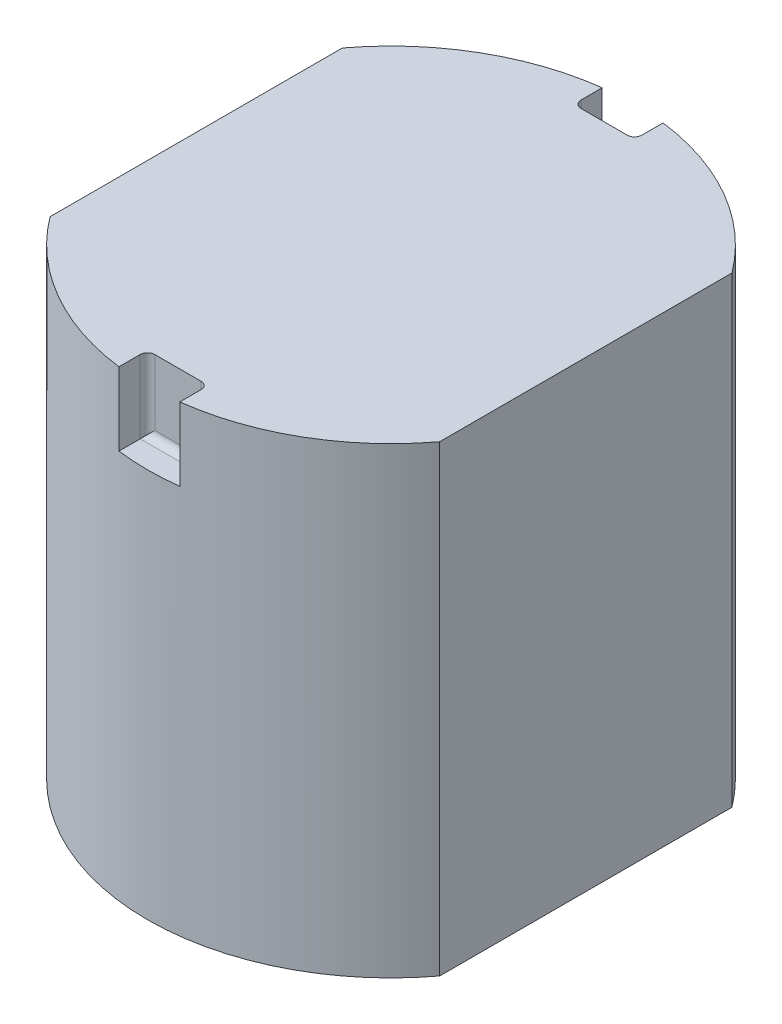
ISO-10303-21;
HEADER;
FILE_DESCRIPTION(('STEP AP214'),'2;1');
FILE_NAME('part.step','',(''),(''),'','','');
FILE_SCHEMA(('AUTOMOTIVE_DESIGN { 1 0 10303 214 1 1 1 1 }'));
ENDSEC;
DATA;
#1=APPLICATION_CONTEXT('core data for automotive mechanical design processes');
#2=APPLICATION_PROTOCOL_DEFINITION('international standard','automotive_design',2000,#1);
#3=PRODUCT_CONTEXT('',#1,'mechanical');
#4=PRODUCT('Part','Part','',(#3));
#5=PRODUCT_RELATED_PRODUCT_CATEGORY('part','',(#4));
#6=PRODUCT_DEFINITION_FORMATION('','',#4);
#7=PRODUCT_DEFINITION_CONTEXT('part definition',#1,'design');
#8=PRODUCT_DEFINITION('design','',#6,#7);
#9=PRODUCT_DEFINITION_SHAPE('','',#8);
#10=(LENGTH_UNIT() NAMED_UNIT(*) SI_UNIT(.MILLI.,.METRE.));
#11=(NAMED_UNIT(*) PLANE_ANGLE_UNIT() SI_UNIT($,.RADIAN.));
#12=(NAMED_UNIT(*) SI_UNIT($,.STERADIAN.) SOLID_ANGLE_UNIT());
#13=UNCERTAINTY_MEASURE_WITH_UNIT(LENGTH_MEASURE(1.E-05),#10,'distance_accuracy_value','');
#14=(GEOMETRIC_REPRESENTATION_CONTEXT(3) GLOBAL_UNCERTAINTY_ASSIGNED_CONTEXT((#13)) GLOBAL_UNIT_ASSIGNED_CONTEXT((#10,
#11,#12)) REPRESENTATION_CONTEXT('',''));
#15=CARTESIAN_POINT('',(0.,0.,0.));
#16=DIRECTION('',(0.,0.,1.));
#17=DIRECTION('',(1.,0.,0.));
#18=AXIS2_PLACEMENT_3D('',#15,#16,#17);
#19=CARTESIAN_POINT('',(0.,19.,0.));
#20=DIRECTION('',(0.,-1.,0.));
#21=DIRECTION('',(0.,0.,-1.));
#22=AXIS2_PLACEMENT_3D('',#19,#20,#21);
#23=CYLINDRICAL_SURFACE('',#22,10.);
#24=DIRECTION('',(0.,-1.,0.));
#25=VECTOR('',#24,1.);
#26=CARTESIAN_POINT('',(1.25,19.,-9.92156741649222));
#27=LINE('',#26,#25);
#28=CARTESIAN_POINT('',(1.25,19.,-9.92156741649222));
#29=VERTEX_POINT('',#28);
#30=CARTESIAN_POINT('',(1.25,16.,-9.92156741649222));
#31=VERTEX_POINT('',#30);
#32=EDGE_CURVE('E180',#29,#31,#27,.T.);
#33=ORIENTED_EDGE('',*,*,#32,.F.);
#34=CARTESIAN_POINT('',(0.,19.,0.));
#35=DIRECTION('',(0.,1.,0.));
#36=DIRECTION('',(0.,0.,1.));
#37=AXIS2_PLACEMENT_3D('',#34,#35,#36);
#38=CIRCLE('',#37,10.);
#39=CARTESIAN_POINT('',(8.,19.,-6.));
#40=VERTEX_POINT('',#39);
#41=EDGE_CURVE('E204',#40,#29,#38,.T.);
#42=ORIENTED_EDGE('',*,*,#41,.F.);
#43=DIRECTION('',(0.,-1.,0.));
#44=VECTOR('',#43,1.);
#45=CARTESIAN_POINT('',(8.,19.,-6.));
#46=LINE('',#45,#44);
#47=CARTESIAN_POINT('',(8.,0.,-6.));
#48=VERTEX_POINT('',#47);
#49=EDGE_CURVE('E215',#40,#48,#46,.T.);
#50=ORIENTED_EDGE('',*,*,#49,.T.);
#51=CARTESIAN_POINT('',(0.,0.,0.));
#52=DIRECTION('',(0.,1.,0.));
#53=DIRECTION('',(0.,0.,1.));
#54=AXIS2_PLACEMENT_3D('',#51,#52,#53);
#55=CIRCLE('',#54,10.);
#56=CARTESIAN_POINT('',(-8.,0.,-6.));
#57=VERTEX_POINT('',#56);
#58=EDGE_CURVE('E203',#48,#57,#55,.T.);
#59=ORIENTED_EDGE('',*,*,#58,.T.);
#60=DIRECTION('',(0.,-1.,0.));
#61=VECTOR('',#60,1.);
#62=CARTESIAN_POINT('',(-8.,19.,-6.));
#63=LINE('',#62,#61);
#64=CARTESIAN_POINT('',(-8.,19.,-6.));
#65=VERTEX_POINT('',#64);
#66=EDGE_CURVE('E232',#65,#57,#63,.T.);
#67=ORIENTED_EDGE('',*,*,#66,.F.);
#68=CARTESIAN_POINT('',(-1.25,19.,-9.92156741649222));
#69=VERTEX_POINT('',#68);
#70=EDGE_CURVE('E179',#69,#65,#38,.T.);
#71=ORIENTED_EDGE('',*,*,#70,.F.);
#72=DIRECTION('',(0.,-1.,0.));
#73=VECTOR('',#72,1.);
#74=CARTESIAN_POINT('',(-1.25,19.,-9.92156741649222));
#75=LINE('',#74,#73);
#76=CARTESIAN_POINT('',(-1.25,16.,-9.92156741649222));
#77=VERTEX_POINT('',#76);
#78=EDGE_CURVE('E160',#77,#69,#75,.F.);
#79=ORIENTED_EDGE('',*,*,#78,.F.);
#80=CARTESIAN_POINT('',(0.,16.,0.));
#81=DIRECTION('',(0.,1.,0.));
#82=DIRECTION('',(0.,0.,1.));
#83=AXIS2_PLACEMENT_3D('',#80,#81,#82);
#84=CIRCLE('',#83,10.);
#85=EDGE_CURVE('E170',#31,#77,#84,.T.);
#86=ORIENTED_EDGE('',*,*,#85,.F.);
#87=EDGE_LOOP('',(#33,#42,#50,#59,#67,#71,#79,#86));
#88=FACE_BOUND('',#87,.T.);
#89=ADVANCED_FACE('F39',(#88),#23,.T.);
#90=CARTESIAN_POINT('',(0.,19.,0.));
#91=DIRECTION('',(0.,1.,0.));
#92=DIRECTION('',(0.,0.,1.));
#93=AXIS2_PLACEMENT_3D('',#90,#91,#92);
#94=PLANE('',#93);
#95=ORIENTED_EDGE('',*,*,#41,.T.);
#96=DIRECTION('',(0.,0.,1.));
#97=VECTOR('',#96,1.);
#98=CARTESIAN_POINT('',(1.25,19.,0.));
#99=LINE('',#98,#97);
#100=CARTESIAN_POINT('',(1.25,19.,-9.05));
#101=VERTEX_POINT('',#100);
#102=EDGE_CURVE('E176',#29,#101,#99,.T.);
#103=ORIENTED_EDGE('',*,*,#102,.T.);
#104=CARTESIAN_POINT('',(0.950000000000001,19.,-9.05));
#105=DIRECTION('',(0.,1.,0.));
#106=DIRECTION('',(0.,0.,1.));
#107=AXIS2_PLACEMENT_3D('',#104,#105,#106);
#108=CIRCLE('',#107,0.3);
#109=CARTESIAN_POINT('',(0.950000000000001,19.,-8.75));
#110=VERTEX_POINT('',#109);
#111=EDGE_CURVE('E264',#101,#110,#108,.F.);
#112=ORIENTED_EDGE('',*,*,#111,.T.);
#113=DIRECTION('',(-1.,0.,0.));
#114=VECTOR('',#113,1.);
#115=CARTESIAN_POINT('',(-1.25,19.,-8.75));
#116=LINE('',#115,#114);
#117=CARTESIAN_POINT('',(-0.95,19.,-8.75));
#118=VERTEX_POINT('',#117);
#119=EDGE_CURVE('E185',#110,#118,#116,.T.);
#120=ORIENTED_EDGE('',*,*,#119,.T.);
#121=CARTESIAN_POINT('',(-0.95,19.,-9.05));
#122=DIRECTION('',(0.,1.,0.));
#123=DIRECTION('',(0.,0.,1.));
#124=AXIS2_PLACEMENT_3D('',#121,#122,#123);
#125=CIRCLE('',#124,0.3);
#126=CARTESIAN_POINT('',(-1.25,19.,-9.05));
#127=VERTEX_POINT('',#126);
#128=EDGE_CURVE('E266',#118,#127,#125,.F.);
#129=ORIENTED_EDGE('',*,*,#128,.T.);
#130=DIRECTION('',(0.,0.,-1.));
#131=VECTOR('',#130,1.);
#132=CARTESIAN_POINT('',(-1.25,19.,-8.75));
#133=LINE('',#132,#131);
#134=EDGE_CURVE('E273',#127,#69,#133,.T.);
#135=ORIENTED_EDGE('',*,*,#134,.T.);
#136=ORIENTED_EDGE('',*,*,#70,.T.);
#137=DIRECTION('',(0.,0.,1.));
#138=VECTOR('',#137,1.);
#139=CARTESIAN_POINT('',(-8.,19.,6.));
#140=LINE('',#139,#138);
#141=CARTESIAN_POINT('',(-8.,19.,6.));
#142=VERTEX_POINT('',#141);
#143=EDGE_CURVE('E207',#65,#142,#140,.T.);
#144=ORIENTED_EDGE('',*,*,#143,.T.);
#145=CARTESIAN_POINT('',(0.,19.,0.));
#146=DIRECTION('',(0.,1.,0.));
#147=DIRECTION('',(0.,0.,1.));
#148=AXIS2_PLACEMENT_3D('',#145,#146,#147);
#149=CIRCLE('',#148,10.);
#150=CARTESIAN_POINT('',(-1.25,19.,9.92156741649222));
#151=VERTEX_POINT('',#150);
#152=EDGE_CURVE('E210',#142,#151,#149,.T.);
#153=ORIENTED_EDGE('',*,*,#152,.T.);
#154=DIRECTION('',(0.,0.,1.));
#155=VECTOR('',#154,1.);
#156=CARTESIAN_POINT('',(-1.25,19.,8.75));
#157=LINE('',#156,#155);
#158=CARTESIAN_POINT('',(-1.25,19.,9.05));
#159=VERTEX_POINT('',#158);
#160=EDGE_CURVE('E192',#159,#151,#157,.T.);
#161=ORIENTED_EDGE('',*,*,#160,.F.);
#162=CARTESIAN_POINT('',(-0.95,19.,9.05));
#163=DIRECTION('',(0.,1.,0.));
#164=DIRECTION('',(0.,0.,1.));
#165=AXIS2_PLACEMENT_3D('',#162,#163,#164);
#166=CIRCLE('',#165,0.3);
#167=CARTESIAN_POINT('',(-0.95,19.,8.75));
#168=VERTEX_POINT('',#167);
#169=EDGE_CURVE('E11',#159,#168,#166,.F.);
#170=ORIENTED_EDGE('',*,*,#169,.T.);
#171=DIRECTION('',(-1.,0.,0.));
#172=VECTOR('',#171,1.);
#173=CARTESIAN_POINT('',(-1.25,19.,8.75));
#174=LINE('',#173,#172);
#175=CARTESIAN_POINT('',(0.950000000000001,19.,8.75));
#176=VERTEX_POINT('',#175);
#177=EDGE_CURVE('E182',#176,#168,#174,.T.);
#178=ORIENTED_EDGE('',*,*,#177,.F.);
#179=CARTESIAN_POINT('',(0.950000000000001,19.,9.05));
#180=DIRECTION('',(0.,1.,0.));
#181=DIRECTION('',(0.,0.,1.));
#182=AXIS2_PLACEMENT_3D('',#179,#180,#181);
#183=CIRCLE('',#182,0.3);
#184=CARTESIAN_POINT('',(1.25,19.,9.05));
#185=VERTEX_POINT('',#184);
#186=EDGE_CURVE('E48',#176,#185,#183,.F.);
#187=ORIENTED_EDGE('',*,*,#186,.T.);
#188=DIRECTION('',(0.,0.,-1.));
#189=VECTOR('',#188,1.);
#190=CARTESIAN_POINT('',(1.25,19.,0.));
#191=LINE('',#190,#189);
#192=CARTESIAN_POINT('',(1.25,19.,9.92156741649222));
#193=VERTEX_POINT('',#192);
#194=EDGE_CURVE('E235',#193,#185,#191,.T.);
#195=ORIENTED_EDGE('',*,*,#194,.F.);
#196=CARTESIAN_POINT('',(8.,19.,6.));
#197=VERTEX_POINT('',#196);
#198=EDGE_CURVE('E209',#193,#197,#149,.T.);
#199=ORIENTED_EDGE('',*,*,#198,.T.);
#200=DIRECTION('',(0.,0.,-1.));
#201=VECTOR('',#200,1.);
#202=CARTESIAN_POINT('',(8.,19.,6.));
#203=LINE('',#202,#201);
#204=EDGE_CURVE('E213',#197,#40,#203,.T.);
#205=ORIENTED_EDGE('',*,*,#204,.T.);
#206=EDGE_LOOP('',(#95,#103,#112,#120,#129,#135,#136,#144,#153,#161,#170,#178,#187,#195,#199,#205));
#207=FACE_BOUND('',#206,.T.);
#208=ADVANCED_FACE('F288',(#207),#94,.T.);
#209=CARTESIAN_POINT('',(-8.,19.,6.));
#210=DIRECTION('',(1.,0.,0.));
#211=DIRECTION('',(0.,0.,-1.));
#212=AXIS2_PLACEMENT_3D('',#209,#210,#211);
#213=PLANE('',#212);
#214=DIRECTION('',(0.,0.,1.));
#215=VECTOR('',#214,1.);
#216=CARTESIAN_POINT('',(-8.,0.,6.));
#217=LINE('',#216,#215);
#218=CARTESIAN_POINT('',(-8.,0.,6.));
#219=VERTEX_POINT('',#218);
#220=EDGE_CURVE('E218',#57,#219,#217,.T.);
#221=ORIENTED_EDGE('',*,*,#220,.T.);
#222=DIRECTION('',(0.,-1.,0.));
#223=VECTOR('',#222,1.);
#224=CARTESIAN_POINT('',(-8.,19.,6.));
#225=LINE('',#224,#223);
#226=EDGE_CURVE('E229',#142,#219,#225,.T.);
#227=ORIENTED_EDGE('',*,*,#226,.F.);
#228=ORIENTED_EDGE('',*,*,#143,.F.);
#229=ORIENTED_EDGE('',*,*,#66,.T.);
#230=EDGE_LOOP('',(#221,#227,#228,#229));
#231=FACE_BOUND('',#230,.T.);
#232=ADVANCED_FACE('F349',(#231),#213,.F.);
#233=CARTESIAN_POINT('',(0.,19.,0.));
#234=DIRECTION('',(0.,-1.,0.));
#235=DIRECTION('',(0.,0.,-1.));
#236=AXIS2_PLACEMENT_3D('',#233,#234,#235);
#237=CYLINDRICAL_SURFACE('',#236,10.);
#238=ORIENTED_EDGE('',*,*,#198,.F.);
#239=DIRECTION('',(0.,-1.,0.));
#240=VECTOR('',#239,1.);
#241=CARTESIAN_POINT('',(1.25,19.,9.92156741649222));
#242=LINE('',#241,#240);
#243=CARTESIAN_POINT('',(1.25,16.,9.92156741649222));
#244=VERTEX_POINT('',#243);
#245=EDGE_CURVE('E200',#193,#244,#242,.T.);
#246=ORIENTED_EDGE('',*,*,#245,.T.);
#247=CARTESIAN_POINT('',(0.,16.,0.));
#248=DIRECTION('',(0.,1.,0.));
#249=DIRECTION('',(0.,0.,1.));
#250=AXIS2_PLACEMENT_3D('',#247,#248,#249);
#251=CIRCLE('',#250,10.);
#252=CARTESIAN_POINT('',(-1.25,16.,9.92156741649222));
#253=VERTEX_POINT('',#252);
#254=EDGE_CURVE('E237',#253,#244,#251,.T.);
#255=ORIENTED_EDGE('',*,*,#254,.F.);
#256=DIRECTION('',(0.,-1.,0.));
#257=VECTOR('',#256,1.);
#258=CARTESIAN_POINT('',(-1.25,19.,9.92156741649222));
#259=LINE('',#258,#257);
#260=EDGE_CURVE('E194',#253,#151,#259,.F.);
#261=ORIENTED_EDGE('',*,*,#260,.T.);
#262=ORIENTED_EDGE('',*,*,#152,.F.);
#263=ORIENTED_EDGE('',*,*,#226,.T.);
#264=CARTESIAN_POINT('',(0.,0.,0.));
#265=DIRECTION('',(0.,1.,0.));
#266=DIRECTION('',(0.,0.,1.));
#267=AXIS2_PLACEMENT_3D('',#264,#265,#266);
#268=CIRCLE('',#267,10.);
#269=CARTESIAN_POINT('',(8.,0.,6.));
#270=VERTEX_POINT('',#269);
#271=EDGE_CURVE('E220',#219,#270,#268,.T.);
#272=ORIENTED_EDGE('',*,*,#271,.T.);
#273=DIRECTION('',(0.,-1.,0.));
#274=VECTOR('',#273,1.);
#275=CARTESIAN_POINT('',(8.,19.,6.));
#276=LINE('',#275,#274);
#277=EDGE_CURVE('E226',#197,#270,#276,.T.);
#278=ORIENTED_EDGE('',*,*,#277,.F.);
#279=EDGE_LOOP('',(#238,#246,#255,#261,#262,#263,#272,#278));
#280=FACE_BOUND('',#279,.T.);
#281=ADVANCED_FACE('F301',(#280),#237,.T.);
#282=CARTESIAN_POINT('',(8.,19.,6.));
#283=DIRECTION('',(-1.,0.,0.));
#284=DIRECTION('',(0.,0.,1.));
#285=AXIS2_PLACEMENT_3D('',#282,#283,#284);
#286=PLANE('',#285);
#287=DIRECTION('',(0.,0.,-1.));
#288=VECTOR('',#287,1.);
#289=CARTESIAN_POINT('',(8.,0.,6.));
#290=LINE('',#289,#288);
#291=EDGE_CURVE('E222',#270,#48,#290,.T.);
#292=ORIENTED_EDGE('',*,*,#291,.T.);
#293=ORIENTED_EDGE('',*,*,#49,.F.);
#294=ORIENTED_EDGE('',*,*,#204,.F.);
#295=ORIENTED_EDGE('',*,*,#277,.T.);
#296=EDGE_LOOP('',(#292,#293,#294,#295));
#297=FACE_BOUND('',#296,.T.);
#298=ADVANCED_FACE('F310',(#297),#286,.F.);
#299=CARTESIAN_POINT('',(0.,0.,0.));
#300=DIRECTION('',(0.,1.,0.));
#301=DIRECTION('',(0.,0.,1.));
#302=AXIS2_PLACEMENT_3D('',#299,#300,#301);
#303=PLANE('',#302);
#304=ORIENTED_EDGE('',*,*,#58,.F.);
#305=ORIENTED_EDGE('',*,*,#291,.F.);
#306=ORIENTED_EDGE('',*,*,#271,.F.);
#307=ORIENTED_EDGE('',*,*,#220,.F.);
#308=EDGE_LOOP('',(#304,#305,#306,#307));
#309=FACE_BOUND('',#308,.T.);
#310=ADVANCED_FACE('F358',(#309),#303,.F.);
#311=CARTESIAN_POINT('',(0.,16.,0.));
#312=DIRECTION('',(0.,1.,0.));
#313=DIRECTION('',(0.,0.,1.));
#314=AXIS2_PLACEMENT_3D('',#311,#312,#313);
#315=PLANE('',#314);
#316=DIRECTION('',(0.,0.,-1.));
#317=VECTOR('',#316,1.);
#318=CARTESIAN_POINT('',(1.25,16.,8.75));
#319=LINE('',#318,#317);
#320=CARTESIAN_POINT('',(1.25,16.,9.05));
#321=VERTEX_POINT('',#320);
#322=EDGE_CURVE('E188',#244,#321,#319,.T.);
#323=ORIENTED_EDGE('',*,*,#322,.T.);
#324=DIRECTION('',(-1.,0.,0.));
#325=VECTOR('',#324,1.);
#326=CARTESIAN_POINT('',(0.,16.,9.05));
#327=LINE('',#326,#325);
#328=CARTESIAN_POINT('',(-1.25,16.,9.05));
#329=VERTEX_POINT('',#328);
#330=EDGE_CURVE('E249',#321,#329,#327,.T.);
#331=ORIENTED_EDGE('',*,*,#330,.T.);
#332=DIRECTION('',(0.,0.,1.));
#333=VECTOR('',#332,1.);
#334=CARTESIAN_POINT('',(-1.25,16.,8.75));
#335=LINE('',#334,#333);
#336=EDGE_CURVE('E191',#329,#253,#335,.T.);
#337=ORIENTED_EDGE('',*,*,#336,.T.);
#338=ORIENTED_EDGE('',*,*,#254,.T.);
#339=EDGE_LOOP('',(#323,#331,#337,#338));
#340=FACE_BOUND('',#339,.T.);
#341=ADVANCED_FACE('F293',(#340),#315,.T.);
#342=CARTESIAN_POINT('',(1.25,16.,8.75));
#343=DIRECTION('',(1.,0.,0.));
#344=DIRECTION('',(0.,0.,-1.));
#345=AXIS2_PLACEMENT_3D('',#342,#343,#344);
#346=PLANE('',#345);
#347=ORIENTED_EDGE('',*,*,#194,.T.);
#348=DIRECTION('',(0.,1.,0.));
#349=VECTOR('',#348,1.);
#350=CARTESIAN_POINT('',(1.25,16.,9.05));
#351=LINE('',#350,#349);
#352=EDGE_CURVE('E261',#185,#321,#351,.F.);
#353=ORIENTED_EDGE('',*,*,#352,.T.);
#354=ORIENTED_EDGE('',*,*,#322,.F.);
#355=ORIENTED_EDGE('',*,*,#245,.F.);
#356=EDGE_LOOP('',(#347,#353,#354,#355));
#357=FACE_BOUND('',#356,.T.);
#358=ADVANCED_FACE('F303',(#357),#346,.F.);
#359=CARTESIAN_POINT('',(-1.25,16.,8.75));
#360=DIRECTION('',(-1.,0.,0.));
#361=DIRECTION('',(0.,0.,1.));
#362=AXIS2_PLACEMENT_3D('',#359,#360,#361);
#363=PLANE('',#362);
#364=ORIENTED_EDGE('',*,*,#336,.F.);
#365=DIRECTION('',(0.,1.,0.));
#366=VECTOR('',#365,1.);
#367=CARTESIAN_POINT('',(-1.25,19.,9.05));
#368=LINE('',#367,#366);
#369=EDGE_CURVE('E56',#329,#159,#368,.T.);
#370=ORIENTED_EDGE('',*,*,#369,.T.);
#371=ORIENTED_EDGE('',*,*,#160,.T.);
#372=ORIENTED_EDGE('',*,*,#260,.F.);
#373=EDGE_LOOP('',(#364,#370,#371,#372));
#374=FACE_BOUND('',#373,.T.);
#375=ADVANCED_FACE('F296',(#374),#363,.F.);
#376=CARTESIAN_POINT('',(-1.25,16.,8.75));
#377=DIRECTION('',(0.,0.,-1.));
#378=DIRECTION('',(-1.,0.,0.));
#379=AXIS2_PLACEMENT_3D('',#376,#377,#378);
#380=PLANE('',#379);
#381=DIRECTION('',(-1.,0.,0.));
#382=VECTOR('',#381,1.);
#383=CARTESIAN_POINT('',(-1.25,16.3,8.75));
#384=LINE('',#383,#382);
#385=CARTESIAN_POINT('',(-0.95,16.3,8.75));
#386=VERTEX_POINT('',#385);
#387=CARTESIAN_POINT('',(0.950000000000001,16.3,8.75));
#388=VERTEX_POINT('',#387);
#389=EDGE_CURVE('E254',#386,#388,#384,.F.);
#390=ORIENTED_EDGE('',*,*,#389,.T.);
#391=DIRECTION('',(0.,1.,0.));
#392=VECTOR('',#391,1.);
#393=CARTESIAN_POINT('',(0.950000000000001,19.,8.75));
#394=LINE('',#393,#392);
#395=EDGE_CURVE('E256',#388,#176,#394,.T.);
#396=ORIENTED_EDGE('',*,*,#395,.T.);
#397=ORIENTED_EDGE('',*,*,#177,.T.);
#398=DIRECTION('',(0.,1.,0.));
#399=VECTOR('',#398,1.);
#400=CARTESIAN_POINT('',(-0.95,16.,8.75));
#401=LINE('',#400,#399);
#402=EDGE_CURVE('E252',#168,#386,#401,.F.);
#403=ORIENTED_EDGE('',*,*,#402,.T.);
#404=EDGE_LOOP('',(#390,#396,#397,#403));
#405=FACE_BOUND('',#404,.T.);
#406=ADVANCED_FACE('F286',(#405),#380,.F.);
#407=CARTESIAN_POINT('',(0.,16.,0.));
#408=DIRECTION('',(0.,1.,0.));
#409=DIRECTION('',(0.,0.,-1.));
#410=AXIS2_PLACEMENT_3D('',#407,#408,#409);
#411=PLANE('',#410);
#412=DIRECTION('',(0.,0.,-1.));
#413=VECTOR('',#412,1.);
#414=CARTESIAN_POINT('',(-1.25,16.,-8.75));
#415=LINE('',#414,#413);
#416=CARTESIAN_POINT('',(-1.25,16.,-9.05));
#417=VERTEX_POINT('',#416);
#418=EDGE_CURVE('E155',#417,#77,#415,.T.);
#419=ORIENTED_EDGE('',*,*,#418,.F.);
#420=DIRECTION('',(-1.,0.,0.));
#421=VECTOR('',#420,1.);
#422=CARTESIAN_POINT('',(1.25,16.,-9.05));
#423=LINE('',#422,#421);
#424=CARTESIAN_POINT('',(1.25,16.,-9.05));
#425=VERTEX_POINT('',#424);
#426=EDGE_CURVE('E247',#417,#425,#423,.F.);
#427=ORIENTED_EDGE('',*,*,#426,.T.);
#428=DIRECTION('',(0.,0.,1.));
#429=VECTOR('',#428,1.);
#430=CARTESIAN_POINT('',(1.25,16.,-8.75));
#431=LINE('',#430,#429);
#432=EDGE_CURVE('E166',#31,#425,#431,.T.);
#433=ORIENTED_EDGE('',*,*,#432,.F.);
#434=ORIENTED_EDGE('',*,*,#85,.T.);
#435=EDGE_LOOP('',(#419,#427,#433,#434));
#436=FACE_BOUND('',#435,.T.);
#437=ADVANCED_FACE('F171',(#436),#411,.T.);
#438=CARTESIAN_POINT('',(1.25,16.,-8.75));
#439=DIRECTION('',(-1.,0.,0.));
#440=DIRECTION('',(0.,0.,1.));
#441=AXIS2_PLACEMENT_3D('',#438,#439,#440);
#442=PLANE('',#441);
#443=ORIENTED_EDGE('',*,*,#432,.T.);
#444=DIRECTION('',(0.,1.,0.));
#445=VECTOR('',#444,1.);
#446=CARTESIAN_POINT('',(1.25,19.,-9.05));
#447=LINE('',#446,#445);
#448=EDGE_CURVE('E258',#425,#101,#447,.T.);
#449=ORIENTED_EDGE('',*,*,#448,.T.);
#450=ORIENTED_EDGE('',*,*,#102,.F.);
#451=ORIENTED_EDGE('',*,*,#32,.T.);
#452=EDGE_LOOP('',(#443,#449,#450,#451));
#453=FACE_BOUND('',#452,.T.);
#454=ADVANCED_FACE('F315',(#453),#442,.T.);
#455=CARTESIAN_POINT('',(-1.25,16.,-8.75));
#456=DIRECTION('',(1.,0.,0.));
#457=DIRECTION('',(0.,0.,-1.));
#458=AXIS2_PLACEMENT_3D('',#455,#456,#457);
#459=PLANE('',#458);
#460=ORIENTED_EDGE('',*,*,#134,.F.);
#461=DIRECTION('',(0.,1.,0.));
#462=VECTOR('',#461,1.);
#463=CARTESIAN_POINT('',(-1.25,16.,-9.05));
#464=LINE('',#463,#462);
#465=EDGE_CURVE('E163',#127,#417,#464,.F.);
#466=ORIENTED_EDGE('',*,*,#465,.T.);
#467=ORIENTED_EDGE('',*,*,#418,.T.);
#468=ORIENTED_EDGE('',*,*,#78,.T.);
#469=EDGE_LOOP('',(#460,#466,#467,#468));
#470=FACE_BOUND('',#469,.T.);
#471=ADVANCED_FACE('F158',(#470),#459,.T.);
#472=CARTESIAN_POINT('',(-1.25,16.,-8.75));
#473=DIRECTION('',(0.,0.,-1.));
#474=DIRECTION('',(-1.,0.,0.));
#475=AXIS2_PLACEMENT_3D('',#472,#473,#474);
#476=PLANE('',#475);
#477=ORIENTED_EDGE('',*,*,#119,.F.);
#478=DIRECTION('',(0.,1.,0.));
#479=VECTOR('',#478,1.);
#480=CARTESIAN_POINT('',(0.950000000000001,16.,-8.75));
#481=LINE('',#480,#479);
#482=CARTESIAN_POINT('',(0.950000000000001,16.3,-8.75));
#483=VERTEX_POINT('',#482);
#484=EDGE_CURVE('E245',#110,#483,#481,.F.);
#485=ORIENTED_EDGE('',*,*,#484,.T.);
#486=DIRECTION('',(-1.,0.,0.));
#487=VECTOR('',#486,1.);
#488=CARTESIAN_POINT('',(-1.25,16.3,-8.75));
#489=LINE('',#488,#487);
#490=CARTESIAN_POINT('',(-0.95,16.3,-8.75));
#491=VERTEX_POINT('',#490);
#492=EDGE_CURVE('E242',#483,#491,#489,.T.);
#493=ORIENTED_EDGE('',*,*,#492,.T.);
#494=DIRECTION('',(0.,1.,0.));
#495=VECTOR('',#494,1.);
#496=CARTESIAN_POINT('',(-0.95,19.,-8.75));
#497=LINE('',#496,#495);
#498=EDGE_CURVE('E175',#491,#118,#497,.T.);
#499=ORIENTED_EDGE('',*,*,#498,.T.);
#500=EDGE_LOOP('',(#477,#485,#493,#499));
#501=FACE_BOUND('',#500,.T.);
#502=ADVANCED_FACE('F328',(#501),#476,.T.);
#503=CARTESIAN_POINT('',(0.950000000000001,16.,-9.05));
#504=DIRECTION('',(0.,-1.,0.));
#505=DIRECTION('',(0.,0.,-1.));
#506=AXIS2_PLACEMENT_3D('',#503,#504,#505);
#507=CYLINDRICAL_SURFACE('',#506,0.3);
#508=ORIENTED_EDGE('',*,*,#111,.F.);
#509=ORIENTED_EDGE('',*,*,#448,.F.);
#510=CARTESIAN_POINT('',(0.950000000000001,16.3,-9.05));
#511=DIRECTION('',(0.707106781186547,0.707106781186547,0.));
#512=DIRECTION('',(0.707106781186547,-0.707106781186547,0.));
#513=AXIS2_PLACEMENT_3D('',#510,#511,#512);
#514=ELLIPSE('',#513,0.424264068711928,0.3);
#515=EDGE_CURVE('E271',#483,#425,#514,.T.);
#516=ORIENTED_EDGE('',*,*,#515,.F.);
#517=ORIENTED_EDGE('',*,*,#484,.F.);
#518=EDGE_LOOP('',(#508,#509,#516,#517));
#519=FACE_BOUND('',#518,.T.);
#520=ADVANCED_FACE('F319',(#519),#507,.F.);
#521=CARTESIAN_POINT('',(-0.95,16.,-9.05));
#522=DIRECTION('',(0.,-1.,0.));
#523=DIRECTION('',(0.,0.,-1.));
#524=AXIS2_PLACEMENT_3D('',#521,#522,#523);
#525=CYLINDRICAL_SURFACE('',#524,0.3);
#526=ORIENTED_EDGE('',*,*,#128,.F.);
#527=ORIENTED_EDGE('',*,*,#498,.F.);
#528=CARTESIAN_POINT('',(-0.95,16.3,-9.05));
#529=DIRECTION('',(0.707106781186547,-0.707106781186547,0.));
#530=DIRECTION('',(0.707106781186547,0.707106781186547,0.));
#531=AXIS2_PLACEMENT_3D('',#528,#529,#530);
#532=ELLIPSE('',#531,0.424264068711928,0.3);
#533=EDGE_CURVE('E269',#417,#491,#532,.F.);
#534=ORIENTED_EDGE('',*,*,#533,.F.);
#535=ORIENTED_EDGE('',*,*,#465,.F.);
#536=EDGE_LOOP('',(#526,#527,#534,#535));
#537=FACE_BOUND('',#536,.T.);
#538=ADVANCED_FACE('F334',(#537),#525,.F.);
#539=CARTESIAN_POINT('',(-1.25,16.3,-9.05));
#540=DIRECTION('',(1.,0.,0.));
#541=DIRECTION('',(0.,0.,-1.));
#542=AXIS2_PLACEMENT_3D('',#539,#540,#541);
#543=CYLINDRICAL_SURFACE('',#542,0.3);
#544=ORIENTED_EDGE('',*,*,#515,.T.);
#545=ORIENTED_EDGE('',*,*,#426,.F.);
#546=ORIENTED_EDGE('',*,*,#533,.T.);
#547=ORIENTED_EDGE('',*,*,#492,.F.);
#548=EDGE_LOOP('',(#544,#545,#546,#547));
#549=FACE_BOUND('',#548,.T.);
#550=ADVANCED_FACE('F323',(#549),#543,.F.);
#551=CARTESIAN_POINT('',(0.950000000000001,16.,9.05));
#552=DIRECTION('',(0.,-1.,0.));
#553=DIRECTION('',(0.,0.,-1.));
#554=AXIS2_PLACEMENT_3D('',#551,#552,#553);
#555=CYLINDRICAL_SURFACE('',#554,0.3);
#556=ORIENTED_EDGE('',*,*,#186,.F.);
#557=ORIENTED_EDGE('',*,*,#395,.F.);
#558=CARTESIAN_POINT('',(0.950000000000001,16.3,9.05));
#559=DIRECTION('',(-0.707106781186547,-0.707106781186547,0.));
#560=DIRECTION('',(-0.707106781186547,0.707106781186547,0.));
#561=AXIS2_PLACEMENT_3D('',#558,#559,#560);
#562=ELLIPSE('',#561,0.424264068711928,0.3);
#563=EDGE_CURVE('E43',#321,#388,#562,.F.);
#564=ORIENTED_EDGE('',*,*,#563,.F.);
#565=ORIENTED_EDGE('',*,*,#352,.F.);
#566=EDGE_LOOP('',(#556,#557,#564,#565));
#567=FACE_BOUND('',#566,.T.);
#568=ADVANCED_FACE('F41',(#567),#555,.F.);
#569=CARTESIAN_POINT('',(-0.95,16.,9.05));
#570=DIRECTION('',(0.,-1.,0.));
#571=DIRECTION('',(0.,0.,-1.));
#572=AXIS2_PLACEMENT_3D('',#569,#570,#571);
#573=CYLINDRICAL_SURFACE('',#572,0.3);
#574=ORIENTED_EDGE('',*,*,#169,.F.);
#575=ORIENTED_EDGE('',*,*,#369,.F.);
#576=CARTESIAN_POINT('',(-0.95,16.3,9.05));
#577=DIRECTION('',(-0.707106781186547,0.707106781186547,0.));
#578=DIRECTION('',(-0.707106781186547,-0.707106781186547,0.));
#579=AXIS2_PLACEMENT_3D('',#576,#577,#578);
#580=ELLIPSE('',#579,0.424264068711928,0.3);
#581=EDGE_CURVE('E274',#386,#329,#580,.T.);
#582=ORIENTED_EDGE('',*,*,#581,.F.);
#583=ORIENTED_EDGE('',*,*,#402,.F.);
#584=EDGE_LOOP('',(#574,#575,#582,#583));
#585=FACE_BOUND('',#584,.T.);
#586=ADVANCED_FACE('F291',(#585),#573,.F.);
#587=CARTESIAN_POINT('',(0.,16.3,9.05));
#588=DIRECTION('',(-1.,0.,0.));
#589=DIRECTION('',(0.,0.,1.));
#590=AXIS2_PLACEMENT_3D('',#587,#588,#589);
#591=CYLINDRICAL_SURFACE('',#590,0.3);
#592=ORIENTED_EDGE('',*,*,#563,.T.);
#593=ORIENTED_EDGE('',*,*,#389,.F.);
#594=ORIENTED_EDGE('',*,*,#581,.T.);
#595=ORIENTED_EDGE('',*,*,#330,.F.);
#596=EDGE_LOOP('',(#592,#593,#594,#595));
#597=FACE_BOUND('',#596,.T.);
#598=ADVANCED_FACE('F281',(#597),#591,.F.);
#599=CLOSED_SHELL('',(#89,#208,#232,#281,#298,#310,#341,#358,#375,#406,#437,#454,#471,#502,#520,
#538,#550,#568,#586,#598));
#600=MANIFOLD_SOLID_BREP('B2',#599);
#601=ADVANCED_BREP_SHAPE_REPRESENTATION('',(#18,#600),#14);
#602=SHAPE_DEFINITION_REPRESENTATION(#9,#601);
ENDSEC;
END-ISO-10303-21;
